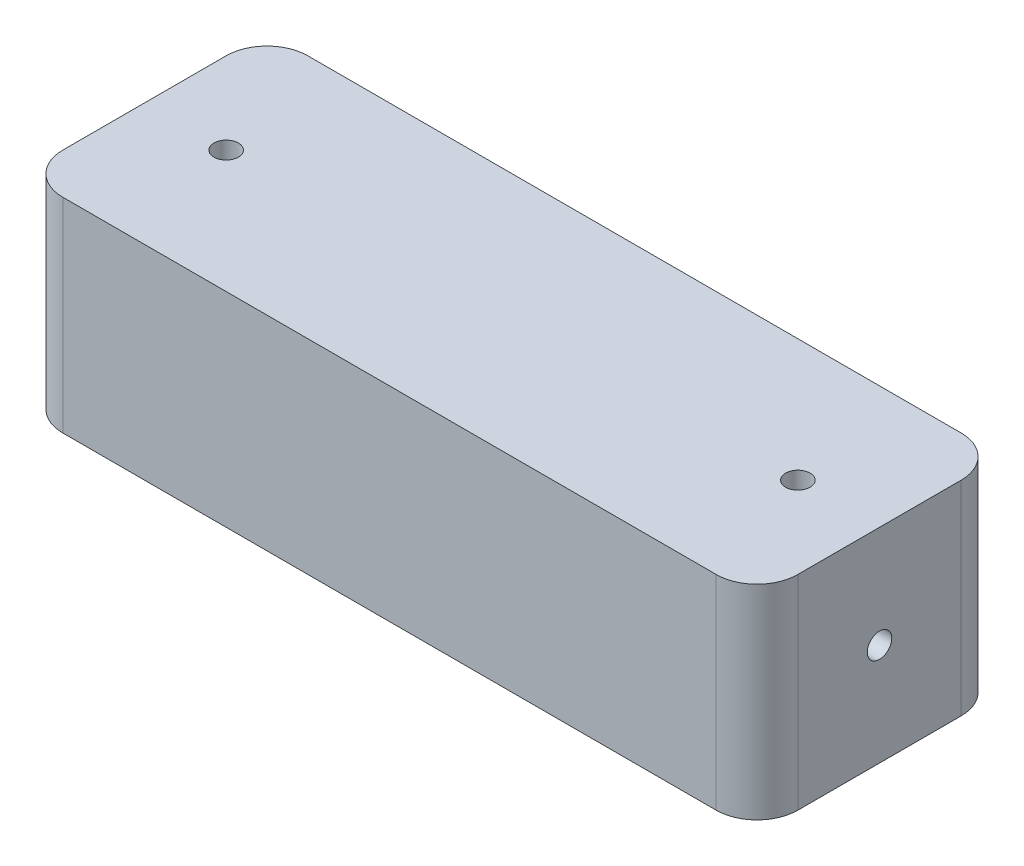
ISO-10303-21;
HEADER;
FILE_DESCRIPTION(('STEP AP214'),'2;1');
FILE_NAME('part.step','',(''),(''),'','','');
FILE_SCHEMA(('AUTOMOTIVE_DESIGN { 1 0 10303 214 1 1 1 1 }'));
ENDSEC;
DATA;
#1=APPLICATION_CONTEXT('core data for automotive mechanical design processes');
#2=APPLICATION_PROTOCOL_DEFINITION('international standard','automotive_design',2000,#1);
#3=PRODUCT_CONTEXT('',#1,'mechanical');
#4=PRODUCT('Part','Part','',(#3));
#5=PRODUCT_RELATED_PRODUCT_CATEGORY('part','',(#4));
#6=PRODUCT_DEFINITION_FORMATION('','',#4);
#7=PRODUCT_DEFINITION_CONTEXT('part definition',#1,'design');
#8=PRODUCT_DEFINITION('design','',#6,#7);
#9=PRODUCT_DEFINITION_SHAPE('','',#8);
#10=(LENGTH_UNIT() NAMED_UNIT(*) SI_UNIT(.MILLI.,.METRE.));
#11=(NAMED_UNIT(*) PLANE_ANGLE_UNIT() SI_UNIT($,.RADIAN.));
#12=(NAMED_UNIT(*) SI_UNIT($,.STERADIAN.) SOLID_ANGLE_UNIT());
#13=UNCERTAINTY_MEASURE_WITH_UNIT(LENGTH_MEASURE(1.E-05),#10,'distance_accuracy_value','');
#14=(GEOMETRIC_REPRESENTATION_CONTEXT(3) GLOBAL_UNCERTAINTY_ASSIGNED_CONTEXT((#13)) GLOBAL_UNIT_ASSIGNED_CONTEXT((#10,
#11,#12)) REPRESENTATION_CONTEXT('',''));
#15=CARTESIAN_POINT('',(0.,0.,0.));
#16=DIRECTION('',(0.,0.,1.));
#17=DIRECTION('',(1.,0.,0.));
#18=AXIS2_PLACEMENT_3D('',#15,#16,#17);
#19=CARTESIAN_POINT('',(0.,50.,0.));
#20=DIRECTION('',(0.,-1.,0.));
#21=DIRECTION('',(0.,0.,-1.));
#22=AXIS2_PLACEMENT_3D('',#19,#20,#21);
#23=PLANE('',#22);
#24=DIRECTION('',(0.,0.,-1.));
#25=VECTOR('',#24,1.);
#26=CARTESIAN_POINT('',(180.,50.,0.));
#27=LINE('',#26,#25);
#28=CARTESIAN_POINT('',(180.,50.,-10.));
#29=VERTEX_POINT('',#28);
#30=CARTESIAN_POINT('',(180.,50.,-50.));
#31=VERTEX_POINT('',#30);
#32=EDGE_CURVE('E221',#29,#31,#27,.T.);
#33=ORIENTED_EDGE('',*,*,#32,.T.);
#34=CARTESIAN_POINT('',(170.,50.,-50.));
#35=DIRECTION('',(0.,-1.,0.));
#36=DIRECTION('',(0.,0.,-1.));
#37=AXIS2_PLACEMENT_3D('',#34,#35,#36);
#38=CIRCLE('',#37,10.);
#39=CARTESIAN_POINT('',(170.,50.,-60.));
#40=VERTEX_POINT('',#39);
#41=EDGE_CURVE('E191',#31,#40,#38,.F.);
#42=ORIENTED_EDGE('',*,*,#41,.T.);
#43=DIRECTION('',(-1.,0.,0.));
#44=VECTOR('',#43,1.);
#45=CARTESIAN_POINT('',(0.,50.,-60.));
#46=LINE('',#45,#44);
#47=CARTESIAN_POINT('',(10.,50.,-60.));
#48=VERTEX_POINT('',#47);
#49=EDGE_CURVE('E148',#40,#48,#46,.T.);
#50=ORIENTED_EDGE('',*,*,#49,.T.);
#51=CARTESIAN_POINT('',(10.,50.,-50.));
#52=DIRECTION('',(0.,-1.,0.));
#53=DIRECTION('',(0.,0.,-1.));
#54=AXIS2_PLACEMENT_3D('',#51,#52,#53);
#55=CIRCLE('',#54,10.);
#56=CARTESIAN_POINT('',(0.,50.,-50.));
#57=VERTEX_POINT('',#56);
#58=EDGE_CURVE('E184',#48,#57,#55,.F.);
#59=ORIENTED_EDGE('',*,*,#58,.T.);
#60=DIRECTION('',(0.,0.,1.));
#61=VECTOR('',#60,1.);
#62=CARTESIAN_POINT('',(0.,50.,0.));
#63=LINE('',#62,#61);
#64=CARTESIAN_POINT('',(0.,50.,-10.));
#65=VERTEX_POINT('',#64);
#66=EDGE_CURVE('E157',#57,#65,#63,.T.);
#67=ORIENTED_EDGE('',*,*,#66,.T.);
#68=CARTESIAN_POINT('',(10.,50.,-10.));
#69=DIRECTION('',(0.,-1.,0.));
#70=DIRECTION('',(0.,0.,-1.));
#71=AXIS2_PLACEMENT_3D('',#68,#69,#70);
#72=CIRCLE('',#71,10.);
#73=CARTESIAN_POINT('',(10.,50.,0.));
#74=VERTEX_POINT('',#73);
#75=EDGE_CURVE('E73',#65,#74,#72,.F.);
#76=ORIENTED_EDGE('',*,*,#75,.T.);
#77=DIRECTION('',(1.,0.,0.));
#78=VECTOR('',#77,1.);
#79=CARTESIAN_POINT('',(0.,50.,0.));
#80=LINE('',#79,#78);
#81=CARTESIAN_POINT('',(170.,50.,0.));
#82=VERTEX_POINT('',#81);
#83=EDGE_CURVE('E163',#74,#82,#80,.T.);
#84=ORIENTED_EDGE('',*,*,#83,.T.);
#85=CARTESIAN_POINT('',(170.,50.,-10.));
#86=DIRECTION('',(0.,-1.,0.));
#87=DIRECTION('',(0.,0.,-1.));
#88=AXIS2_PLACEMENT_3D('',#85,#86,#87);
#89=CIRCLE('',#88,10.);
#90=EDGE_CURVE('E188',#82,#29,#89,.F.);
#91=ORIENTED_EDGE('',*,*,#90,.T.);
#92=EDGE_LOOP('',(#33,#42,#50,#59,#67,#76,#84,#91));
#93=FACE_BOUND('',#92,.T.);
#94=CARTESIAN_POINT('',(20.,50.,-30.));
#95=DIRECTION('',(0.,1.,0.));
#96=DIRECTION('',(0.,0.,1.));
#97=AXIS2_PLACEMENT_3D('',#94,#95,#96);
#98=CIRCLE('',#97,3.);
#99=CARTESIAN_POINT('',(20.,50.,-27.));
#100=VERTEX_POINT('',#99);
#101=EDGE_CURVE('E212',#100,#100,#98,.T.);
#102=ORIENTED_EDGE('',*,*,#101,.F.);
#103=EDGE_LOOP('',(#102));
#104=FACE_BOUND('',#103,.T.);
#105=CARTESIAN_POINT('',(160.,50.,-30.));
#106=DIRECTION('',(0.,1.,0.));
#107=DIRECTION('',(0.,0.,-1.));
#108=AXIS2_PLACEMENT_3D('',#105,#106,#107);
#109=CIRCLE('',#108,2.99999999999999);
#110=CARTESIAN_POINT('',(160.,50.,-33.));
#111=VERTEX_POINT('',#110);
#112=EDGE_CURVE('E228',#111,#111,#109,.T.);
#113=ORIENTED_EDGE('',*,*,#112,.F.);
#114=EDGE_LOOP('',(#113));
#115=FACE_BOUND('',#114,.T.);
#116=ADVANCED_FACE('F47',(#93,#104,#115),#23,.F.);
#117=CARTESIAN_POINT('',(0.,0.,0.));
#118=DIRECTION('',(0.,-1.,0.));
#119=DIRECTION('',(0.,0.,-1.));
#120=AXIS2_PLACEMENT_3D('',#117,#118,#119);
#121=PLANE('',#120);
#122=CARTESIAN_POINT('',(20.,0.,-30.));
#123=DIRECTION('',(0.,1.,0.));
#124=DIRECTION('',(0.,0.,1.));
#125=AXIS2_PLACEMENT_3D('',#122,#123,#124);
#126=CIRCLE('',#125,3.);
#127=CARTESIAN_POINT('',(20.,0.,-27.));
#128=VERTEX_POINT('',#127);
#129=EDGE_CURVE('E216',#128,#128,#126,.T.);
#130=ORIENTED_EDGE('',*,*,#129,.T.);
#131=EDGE_LOOP('',(#130));
#132=FACE_BOUND('',#131,.T.);
#133=DIRECTION('',(-1.,0.,0.));
#134=VECTOR('',#133,1.);
#135=CARTESIAN_POINT('',(0.,0.,-60.));
#136=LINE('',#135,#134);
#137=CARTESIAN_POINT('',(170.,0.,-60.));
#138=VERTEX_POINT('',#137);
#139=CARTESIAN_POINT('',(10.,0.,-60.));
#140=VERTEX_POINT('',#139);
#141=EDGE_CURVE('E145',#138,#140,#136,.T.);
#142=ORIENTED_EDGE('',*,*,#141,.F.);
#143=CARTESIAN_POINT('',(170.,0.,-50.));
#144=DIRECTION('',(0.,-1.,0.));
#145=DIRECTION('',(0.,0.,-1.));
#146=AXIS2_PLACEMENT_3D('',#143,#144,#145);
#147=CIRCLE('',#146,10.);
#148=CARTESIAN_POINT('',(180.,0.,-50.));
#149=VERTEX_POINT('',#148);
#150=EDGE_CURVE('E127',#138,#149,#147,.T.);
#151=ORIENTED_EDGE('',*,*,#150,.T.);
#152=DIRECTION('',(0.,0.,-1.));
#153=VECTOR('',#152,1.);
#154=CARTESIAN_POINT('',(180.,0.,0.));
#155=LINE('',#154,#153);
#156=CARTESIAN_POINT('',(180.,0.,-10.));
#157=VERTEX_POINT('',#156);
#158=EDGE_CURVE('E158',#157,#149,#155,.T.);
#159=ORIENTED_EDGE('',*,*,#158,.F.);
#160=CARTESIAN_POINT('',(170.,0.,-10.));
#161=DIRECTION('',(0.,-1.,0.));
#162=DIRECTION('',(0.,0.,-1.));
#163=AXIS2_PLACEMENT_3D('',#160,#161,#162);
#164=CIRCLE('',#163,10.);
#165=CARTESIAN_POINT('',(170.,0.,0.));
#166=VERTEX_POINT('',#165);
#167=EDGE_CURVE('E139',#157,#166,#164,.T.);
#168=ORIENTED_EDGE('',*,*,#167,.T.);
#169=DIRECTION('',(1.,0.,0.));
#170=VECTOR('',#169,1.);
#171=CARTESIAN_POINT('',(0.,0.,0.));
#172=LINE('',#171,#170);
#173=CARTESIAN_POINT('',(10.,0.,0.));
#174=VERTEX_POINT('',#173);
#175=EDGE_CURVE('E166',#174,#166,#172,.T.);
#176=ORIENTED_EDGE('',*,*,#175,.F.);
#177=CARTESIAN_POINT('',(10.,0.,-10.));
#178=DIRECTION('',(0.,-1.,0.));
#179=DIRECTION('',(0.,0.,-1.));
#180=AXIS2_PLACEMENT_3D('',#177,#178,#179);
#181=CIRCLE('',#180,10.);
#182=CARTESIAN_POINT('',(0.,0.,-10.));
#183=VERTEX_POINT('',#182);
#184=EDGE_CURVE('E174',#174,#183,#181,.T.);
#185=ORIENTED_EDGE('',*,*,#184,.T.);
#186=DIRECTION('',(0.,0.,1.));
#187=VECTOR('',#186,1.);
#188=CARTESIAN_POINT('',(0.,0.,0.));
#189=LINE('',#188,#187);
#190=CARTESIAN_POINT('',(0.,0.,-50.));
#191=VERTEX_POINT('',#190);
#192=EDGE_CURVE('E206',#191,#183,#189,.T.);
#193=ORIENTED_EDGE('',*,*,#192,.F.);
#194=CARTESIAN_POINT('',(10.,0.,-50.));
#195=DIRECTION('',(0.,-1.,0.));
#196=DIRECTION('',(0.,0.,-1.));
#197=AXIS2_PLACEMENT_3D('',#194,#195,#196);
#198=CIRCLE('',#197,10.);
#199=EDGE_CURVE('E150',#191,#140,#198,.T.);
#200=ORIENTED_EDGE('',*,*,#199,.T.);
#201=EDGE_LOOP('',(#142,#151,#159,#168,#176,#185,#193,#200));
#202=FACE_BOUND('',#201,.T.);
#203=CARTESIAN_POINT('',(160.,0.,-30.));
#204=DIRECTION('',(0.,1.,0.));
#205=DIRECTION('',(0.,0.,-1.));
#206=AXIS2_PLACEMENT_3D('',#203,#204,#205);
#207=CIRCLE('',#206,2.99999999999999);
#208=CARTESIAN_POINT('',(160.,0.,-33.));
#209=VERTEX_POINT('',#208);
#210=EDGE_CURVE('E230',#209,#209,#207,.T.);
#211=ORIENTED_EDGE('',*,*,#210,.T.);
#212=EDGE_LOOP('',(#211));
#213=FACE_BOUND('',#212,.T.);
#214=ADVANCED_FACE('F153',(#132,#202,#213),#121,.T.);
#215=CARTESIAN_POINT('',(0.,50.,0.));
#216=DIRECTION('',(1.,0.,0.));
#217=DIRECTION('',(0.,0.,-1.));
#218=AXIS2_PLACEMENT_3D('',#215,#216,#217);
#219=PLANE('',#218);
#220=ORIENTED_EDGE('',*,*,#192,.T.);
#221=DIRECTION('',(0.,-1.,0.));
#222=VECTOR('',#221,1.);
#223=CARTESIAN_POINT('',(0.,50.,-10.));
#224=LINE('',#223,#222);
#225=EDGE_CURVE('E11',#183,#65,#224,.F.);
#226=ORIENTED_EDGE('',*,*,#225,.T.);
#227=ORIENTED_EDGE('',*,*,#66,.F.);
#228=DIRECTION('',(0.,-1.,0.));
#229=VECTOR('',#228,1.);
#230=CARTESIAN_POINT('',(0.,50.,-50.));
#231=LINE('',#230,#229);
#232=EDGE_CURVE('E56',#57,#191,#231,.T.);
#233=ORIENTED_EDGE('',*,*,#232,.T.);
#234=EDGE_LOOP('',(#220,#226,#227,#233));
#235=FACE_BOUND('',#234,.T.);
#236=ADVANCED_FACE('F205',(#235),#219,.F.);
#237=CARTESIAN_POINT('',(0.,50.,0.));
#238=DIRECTION('',(0.,0.,-1.));
#239=DIRECTION('',(-1.,0.,0.));
#240=AXIS2_PLACEMENT_3D('',#237,#238,#239);
#241=PLANE('',#240);
#242=ORIENTED_EDGE('',*,*,#175,.T.);
#243=DIRECTION('',(0.,-1.,0.));
#244=VECTOR('',#243,1.);
#245=CARTESIAN_POINT('',(170.,50.,0.));
#246=LINE('',#245,#244);
#247=EDGE_CURVE('E66',#166,#82,#246,.F.);
#248=ORIENTED_EDGE('',*,*,#247,.T.);
#249=ORIENTED_EDGE('',*,*,#83,.F.);
#250=DIRECTION('',(0.,-1.,0.));
#251=VECTOR('',#250,1.);
#252=CARTESIAN_POINT('',(10.,50.,0.));
#253=LINE('',#252,#251);
#254=EDGE_CURVE('E194',#74,#174,#253,.T.);
#255=ORIENTED_EDGE('',*,*,#254,.T.);
#256=EDGE_LOOP('',(#242,#248,#249,#255));
#257=FACE_BOUND('',#256,.T.);
#258=ADVANCED_FACE('F258',(#257),#241,.F.);
#259=CARTESIAN_POINT('',(180.,50.,0.));
#260=DIRECTION('',(-1.,0.,0.));
#261=DIRECTION('',(0.,0.,1.));
#262=AXIS2_PLACEMENT_3D('',#259,#260,#261);
#263=PLANE('',#262);
#264=CARTESIAN_POINT('',(180.,25.,-30.));
#265=DIRECTION('',(1.,0.,0.));
#266=DIRECTION('',(0.,0.,-1.));
#267=AXIS2_PLACEMENT_3D('',#264,#265,#266);
#268=CIRCLE('',#267,3.);
#269=CARTESIAN_POINT('',(180.,25.,-33.));
#270=VERTEX_POINT('',#269);
#271=EDGE_CURVE('E238',#270,#270,#268,.T.);
#272=ORIENTED_EDGE('',*,*,#271,.F.);
#273=EDGE_LOOP('',(#272));
#274=FACE_BOUND('',#273,.T.);
#275=ORIENTED_EDGE('',*,*,#158,.T.);
#276=DIRECTION('',(0.,-1.,0.));
#277=VECTOR('',#276,1.);
#278=CARTESIAN_POINT('',(180.,50.,-50.));
#279=LINE('',#278,#277);
#280=EDGE_CURVE('E132',#149,#31,#279,.F.);
#281=ORIENTED_EDGE('',*,*,#280,.T.);
#282=ORIENTED_EDGE('',*,*,#32,.F.);
#283=DIRECTION('',(0.,-1.,0.));
#284=VECTOR('',#283,1.);
#285=CARTESIAN_POINT('',(180.,50.,-10.));
#286=LINE('',#285,#284);
#287=EDGE_CURVE('E138',#29,#157,#286,.T.);
#288=ORIENTED_EDGE('',*,*,#287,.T.);
#289=EDGE_LOOP('',(#275,#281,#282,#288));
#290=FACE_BOUND('',#289,.T.);
#291=ADVANCED_FACE('F255',(#274,#290),#263,.F.);
#292=CARTESIAN_POINT('',(0.,50.,-60.));
#293=DIRECTION('',(0.,0.,1.));
#294=DIRECTION('',(1.,0.,0.));
#295=AXIS2_PLACEMENT_3D('',#292,#293,#294);
#296=PLANE('',#295);
#297=ORIENTED_EDGE('',*,*,#49,.F.);
#298=DIRECTION('',(0.,-1.,0.));
#299=VECTOR('',#298,1.);
#300=CARTESIAN_POINT('',(170.,50.,-60.));
#301=LINE('',#300,#299);
#302=EDGE_CURVE('E131',#40,#138,#301,.T.);
#303=ORIENTED_EDGE('',*,*,#302,.T.);
#304=ORIENTED_EDGE('',*,*,#141,.T.);
#305=DIRECTION('',(0.,-1.,0.));
#306=VECTOR('',#305,1.);
#307=CARTESIAN_POINT('',(10.,50.,-60.));
#308=LINE('',#307,#306);
#309=EDGE_CURVE('E151',#140,#48,#308,.F.);
#310=ORIENTED_EDGE('',*,*,#309,.T.);
#311=EDGE_LOOP('',(#297,#303,#304,#310));
#312=FACE_BOUND('',#311,.T.);
#313=ADVANCED_FACE('F144',(#312),#296,.F.);
#314=CARTESIAN_POINT('',(20.,50.,-30.));
#315=DIRECTION('',(0.,-1.,0.));
#316=DIRECTION('',(0.,0.,-1.));
#317=AXIS2_PLACEMENT_3D('',#314,#315,#316);
#318=CYLINDRICAL_SURFACE('',#317,3.);
#319=ORIENTED_EDGE('',*,*,#101,.T.);
#320=EDGE_LOOP('',(#319));
#321=FACE_BOUND('',#320,.T.);
#322=ORIENTED_EDGE('',*,*,#129,.F.);
#323=EDGE_LOOP('',(#322));
#324=FACE_BOUND('',#323,.T.);
#325=ADVANCED_FACE('F282',(#321,#324),#318,.F.);
#326=CARTESIAN_POINT('',(160.,50.,-30.));
#327=DIRECTION('',(0.,-1.,0.));
#328=DIRECTION('',(0.,0.,-1.));
#329=AXIS2_PLACEMENT_3D('',#326,#327,#328);
#330=CYLINDRICAL_SURFACE('',#329,2.99999999999999);
#331=ORIENTED_EDGE('',*,*,#112,.T.);
#332=EDGE_LOOP('',(#331));
#333=FACE_BOUND('',#332,.T.);
#334=ORIENTED_EDGE('',*,*,#210,.F.);
#335=EDGE_LOOP('',(#334));
#336=FACE_BOUND('',#335,.T.);
#337=ADVANCED_FACE('F251',(#333,#336),#330,.F.);
#338=CARTESIAN_POINT('',(170.,25.,-30.));
#339=DIRECTION('',(1.,0.,0.));
#340=DIRECTION('',(0.,0.,-1.));
#341=AXIS2_PLACEMENT_3D('',#338,#339,#340);
#342=CYLINDRICAL_SURFACE('',#341,3.);
#343=CARTESIAN_POINT('',(170.,25.,-30.));
#344=DIRECTION('',(1.,0.,0.));
#345=DIRECTION('',(0.,0.,-1.));
#346=AXIS2_PLACEMENT_3D('',#343,#344,#345);
#347=CIRCLE('',#346,3.);
#348=CARTESIAN_POINT('',(170.,25.,-33.));
#349=VERTEX_POINT('',#348);
#350=EDGE_CURVE('E234',#349,#349,#347,.T.);
#351=ORIENTED_EDGE('',*,*,#350,.F.);
#352=EDGE_LOOP('',(#351));
#353=FACE_BOUND('',#352,.T.);
#354=ORIENTED_EDGE('',*,*,#271,.T.);
#355=EDGE_LOOP('',(#354));
#356=FACE_BOUND('',#355,.T.);
#357=ADVANCED_FACE('F248',(#353,#356),#342,.F.);
#358=CARTESIAN_POINT('',(170.,25.,-30.));
#359=DIRECTION('',(1.,0.,0.));
#360=DIRECTION('',(0.,0.,-1.));
#361=AXIS2_PLACEMENT_3D('',#358,#359,#360);
#362=PLANE('',#361);
#363=ORIENTED_EDGE('',*,*,#350,.T.);
#364=EDGE_LOOP('',(#363));
#365=FACE_BOUND('',#364,.T.);
#366=ADVANCED_FACE('F246',(#365),#362,.T.);
#367=CARTESIAN_POINT('',(170.,50.,-50.));
#368=DIRECTION('',(0.,-1.,0.));
#369=DIRECTION('',(0.,0.,-1.));
#370=AXIS2_PLACEMENT_3D('',#367,#368,#369);
#371=CYLINDRICAL_SURFACE('',#370,10.);
#372=ORIENTED_EDGE('',*,*,#41,.F.);
#373=ORIENTED_EDGE('',*,*,#280,.F.);
#374=ORIENTED_EDGE('',*,*,#150,.F.);
#375=ORIENTED_EDGE('',*,*,#302,.F.);
#376=EDGE_LOOP('',(#372,#373,#374,#375));
#377=FACE_BOUND('',#376,.T.);
#378=ADVANCED_FACE('F130',(#377),#371,.T.);
#379=CARTESIAN_POINT('',(170.,50.,-10.));
#380=DIRECTION('',(0.,-1.,0.));
#381=DIRECTION('',(0.,0.,-1.));
#382=AXIS2_PLACEMENT_3D('',#379,#380,#381);
#383=CYLINDRICAL_SURFACE('',#382,10.);
#384=ORIENTED_EDGE('',*,*,#90,.F.);
#385=ORIENTED_EDGE('',*,*,#247,.F.);
#386=ORIENTED_EDGE('',*,*,#167,.F.);
#387=ORIENTED_EDGE('',*,*,#287,.F.);
#388=EDGE_LOOP('',(#384,#385,#386,#387));
#389=FACE_BOUND('',#388,.T.);
#390=ADVANCED_FACE('F265',(#389),#383,.T.);
#391=CARTESIAN_POINT('',(10.,50.,-10.));
#392=DIRECTION('',(0.,-1.,0.));
#393=DIRECTION('',(0.,0.,-1.));
#394=AXIS2_PLACEMENT_3D('',#391,#392,#393);
#395=CYLINDRICAL_SURFACE('',#394,10.);
#396=ORIENTED_EDGE('',*,*,#75,.F.);
#397=ORIENTED_EDGE('',*,*,#225,.F.);
#398=ORIENTED_EDGE('',*,*,#184,.F.);
#399=ORIENTED_EDGE('',*,*,#254,.F.);
#400=EDGE_LOOP('',(#396,#397,#398,#399));
#401=FACE_BOUND('',#400,.T.);
#402=ADVANCED_FACE('F268',(#401),#395,.T.);
#403=CARTESIAN_POINT('',(10.,50.,-50.));
#404=DIRECTION('',(0.,-1.,0.));
#405=DIRECTION('',(0.,0.,-1.));
#406=AXIS2_PLACEMENT_3D('',#403,#404,#405);
#407=CYLINDRICAL_SURFACE('',#406,10.);
#408=ORIENTED_EDGE('',*,*,#58,.F.);
#409=ORIENTED_EDGE('',*,*,#309,.F.);
#410=ORIENTED_EDGE('',*,*,#199,.F.);
#411=ORIENTED_EDGE('',*,*,#232,.F.);
#412=EDGE_LOOP('',(#408,#409,#410,#411));
#413=FACE_BOUND('',#412,.T.);
#414=ADVANCED_FACE('F49',(#413),#407,.T.);
#415=CLOSED_SHELL('',(#116,#214,#236,#258,#291,#313,#325,#337,#357,#366,#378,#390,#402,#414));
#416=MANIFOLD_SOLID_BREP('B2',#415);
#417=ADVANCED_BREP_SHAPE_REPRESENTATION('',(#18,#416),#14);
#418=SHAPE_DEFINITION_REPRESENTATION(#9,#417);
ENDSEC;
END-ISO-10303-21;
